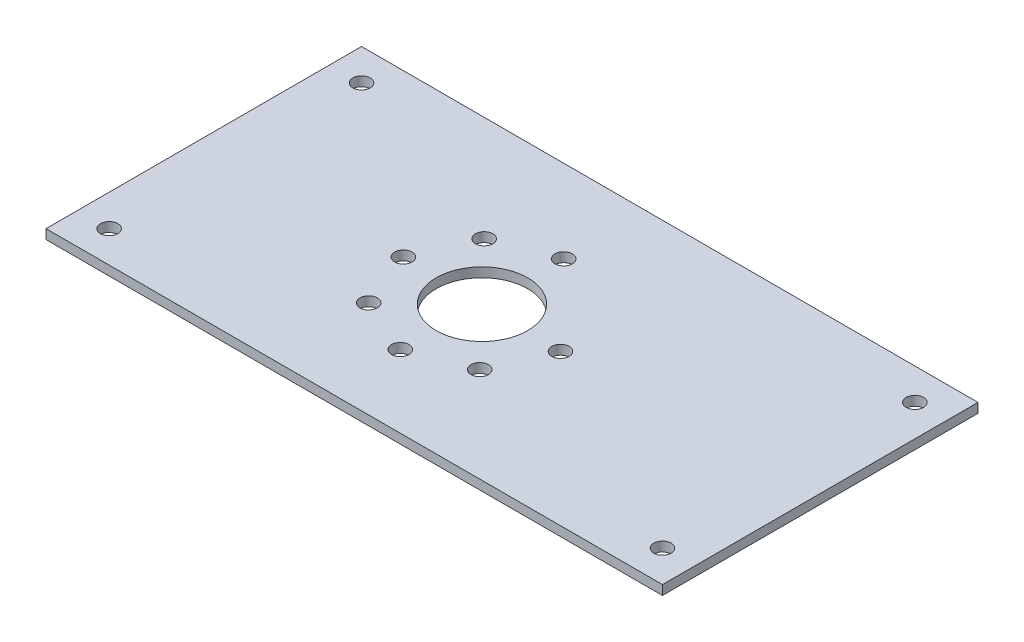
ISO-10303-21;
HEADER;
FILE_DESCRIPTION(('STEP AP214'),'2;1');
FILE_NAME('part.step','',(''),(''),'','','');
FILE_SCHEMA(('AUTOMOTIVE_DESIGN { 1 0 10303 214 1 1 1 1 }'));
ENDSEC;
DATA;
#1=APPLICATION_CONTEXT('core data for automotive mechanical design processes');
#2=APPLICATION_PROTOCOL_DEFINITION('international standard','automotive_design',2000,#1);
#3=PRODUCT_CONTEXT('',#1,'mechanical');
#4=PRODUCT('Part','Part','',(#3));
#5=PRODUCT_RELATED_PRODUCT_CATEGORY('part','',(#4));
#6=PRODUCT_DEFINITION_FORMATION('','',#4);
#7=PRODUCT_DEFINITION_CONTEXT('part definition',#1,'design');
#8=PRODUCT_DEFINITION('design','',#6,#7);
#9=PRODUCT_DEFINITION_SHAPE('','',#8);
#10=(LENGTH_UNIT() NAMED_UNIT(*) SI_UNIT(.MILLI.,.METRE.));
#11=(NAMED_UNIT(*) PLANE_ANGLE_UNIT() SI_UNIT($,.RADIAN.));
#12=(NAMED_UNIT(*) SI_UNIT($,.STERADIAN.) SOLID_ANGLE_UNIT());
#13=UNCERTAINTY_MEASURE_WITH_UNIT(LENGTH_MEASURE(1.E-05),#10,'distance_accuracy_value','');
#14=(GEOMETRIC_REPRESENTATION_CONTEXT(3) GLOBAL_UNCERTAINTY_ASSIGNED_CONTEXT((#13)) GLOBAL_UNIT_ASSIGNED_CONTEXT((#10,
#11,#12)) REPRESENTATION_CONTEXT('',''));
#15=CARTESIAN_POINT('',(0.,0.,0.));
#16=DIRECTION('',(0.,0.,1.));
#17=DIRECTION('',(1.,0.,0.));
#18=AXIS2_PLACEMENT_3D('',#15,#16,#17);
#19=CARTESIAN_POINT('',(0.,3.,0.));
#20=DIRECTION('',(1.,0.,0.));
#21=DIRECTION('',(0.,0.,-1.));
#22=AXIS2_PLACEMENT_3D('',#19,#20,#21);
#23=PLANE('',#22);
#24=DIRECTION('',(0.,0.,1.));
#25=VECTOR('',#24,1.);
#26=CARTESIAN_POINT('',(0.,0.,0.));
#27=LINE('',#26,#25);
#28=CARTESIAN_POINT('',(0.,0.,0.));
#29=VERTEX_POINT('',#28);
#30=CARTESIAN_POINT('',(0.,0.,100.));
#31=VERTEX_POINT('',#30);
#32=EDGE_CURVE('E105',#29,#31,#27,.T.);
#33=ORIENTED_EDGE('',*,*,#32,.T.);
#34=DIRECTION('',(0.,-1.,0.));
#35=VECTOR('',#34,1.);
#36=CARTESIAN_POINT('',(0.,3.,100.));
#37=LINE('',#36,#35);
#38=CARTESIAN_POINT('',(0.,3.,100.));
#39=VERTEX_POINT('',#38);
#40=EDGE_CURVE('E11',#39,#31,#37,.T.);
#41=ORIENTED_EDGE('',*,*,#40,.F.);
#42=DIRECTION('',(0.,0.,1.));
#43=VECTOR('',#42,1.);
#44=CARTESIAN_POINT('',(0.,3.,0.));
#45=LINE('',#44,#43);
#46=CARTESIAN_POINT('',(0.,3.,0.));
#47=VERTEX_POINT('',#46);
#48=EDGE_CURVE('E89',#47,#39,#45,.T.);
#49=ORIENTED_EDGE('',*,*,#48,.F.);
#50=DIRECTION('',(0.,-1.,0.));
#51=VECTOR('',#50,1.);
#52=CARTESIAN_POINT('',(0.,3.,0.));
#53=LINE('',#52,#51);
#54=EDGE_CURVE('E96',#47,#29,#53,.T.);
#55=ORIENTED_EDGE('',*,*,#54,.T.);
#56=EDGE_LOOP('',(#33,#41,#49,#55));
#57=FACE_BOUND('',#56,.T.);
#58=ADVANCED_FACE('F39',(#57),#23,.F.);
#59=CARTESIAN_POINT('',(0.,3.,100.));
#60=DIRECTION('',(0.,0.,-1.));
#61=DIRECTION('',(-1.,0.,0.));
#62=AXIS2_PLACEMENT_3D('',#59,#60,#61);
#63=PLANE('',#62);
#64=DIRECTION('',(1.,0.,0.));
#65=VECTOR('',#64,1.);
#66=CARTESIAN_POINT('',(0.,0.,100.));
#67=LINE('',#66,#65);
#68=CARTESIAN_POINT('',(195.38,0.,100.));
#69=VERTEX_POINT('',#68);
#70=EDGE_CURVE('E91',#31,#69,#67,.T.);
#71=ORIENTED_EDGE('',*,*,#70,.T.);
#72=DIRECTION('',(0.,-1.,0.));
#73=VECTOR('',#72,1.);
#74=CARTESIAN_POINT('',(195.38,3.,100.));
#75=LINE('',#74,#73);
#76=CARTESIAN_POINT('',(195.38,3.,100.));
#77=VERTEX_POINT('',#76);
#78=EDGE_CURVE('E50',#77,#69,#75,.T.);
#79=ORIENTED_EDGE('',*,*,#78,.F.);
#80=DIRECTION('',(1.,0.,0.));
#81=VECTOR('',#80,1.);
#82=CARTESIAN_POINT('',(0.,3.,100.));
#83=LINE('',#82,#81);
#84=EDGE_CURVE('E84',#39,#77,#83,.T.);
#85=ORIENTED_EDGE('',*,*,#84,.F.);
#86=ORIENTED_EDGE('',*,*,#40,.T.);
#87=EDGE_LOOP('',(#71,#79,#85,#86));
#88=FACE_BOUND('',#87,.T.);
#89=ADVANCED_FACE('F94',(#88),#63,.F.);
#90=CARTESIAN_POINT('',(195.38,3.,0.));
#91=DIRECTION('',(-1.,0.,0.));
#92=DIRECTION('',(0.,0.,1.));
#93=AXIS2_PLACEMENT_3D('',#90,#91,#92);
#94=PLANE('',#93);
#95=DIRECTION('',(0.,0.,-1.));
#96=VECTOR('',#95,1.);
#97=CARTESIAN_POINT('',(195.38,0.,0.));
#98=LINE('',#97,#96);
#99=CARTESIAN_POINT('',(195.38,0.,0.));
#100=VERTEX_POINT('',#99);
#101=EDGE_CURVE('E75',#69,#100,#98,.T.);
#102=ORIENTED_EDGE('',*,*,#101,.T.);
#103=DIRECTION('',(0.,-1.,0.));
#104=VECTOR('',#103,1.);
#105=CARTESIAN_POINT('',(195.38,3.,0.));
#106=LINE('',#105,#104);
#107=CARTESIAN_POINT('',(195.38,3.,0.));
#108=VERTEX_POINT('',#107);
#109=EDGE_CURVE('E93',#108,#100,#106,.T.);
#110=ORIENTED_EDGE('',*,*,#109,.F.);
#111=DIRECTION('',(0.,0.,-1.));
#112=VECTOR('',#111,1.);
#113=CARTESIAN_POINT('',(195.38,3.,0.));
#114=LINE('',#113,#112);
#115=EDGE_CURVE('E88',#77,#108,#114,.T.);
#116=ORIENTED_EDGE('',*,*,#115,.F.);
#117=ORIENTED_EDGE('',*,*,#78,.T.);
#118=EDGE_LOOP('',(#102,#110,#116,#117));
#119=FACE_BOUND('',#118,.T.);
#120=ADVANCED_FACE('F98',(#119),#94,.F.);
#121=CARTESIAN_POINT('',(0.,3.,0.));
#122=DIRECTION('',(0.,0.,1.));
#123=DIRECTION('',(1.,0.,0.));
#124=AXIS2_PLACEMENT_3D('',#121,#122,#123);
#125=PLANE('',#124);
#126=DIRECTION('',(-1.,0.,0.));
#127=VECTOR('',#126,1.);
#128=CARTESIAN_POINT('',(0.,0.,0.));
#129=LINE('',#128,#127);
#130=EDGE_CURVE('E76',#100,#29,#129,.T.);
#131=ORIENTED_EDGE('',*,*,#130,.T.);
#132=ORIENTED_EDGE('',*,*,#54,.F.);
#133=DIRECTION('',(-1.,0.,0.));
#134=VECTOR('',#133,1.);
#135=CARTESIAN_POINT('',(0.,3.,0.));
#136=LINE('',#135,#134);
#137=EDGE_CURVE('E54',#108,#47,#136,.T.);
#138=ORIENTED_EDGE('',*,*,#137,.F.);
#139=ORIENTED_EDGE('',*,*,#109,.T.);
#140=EDGE_LOOP('',(#131,#132,#138,#139));
#141=FACE_BOUND('',#140,.T.);
#142=ADVANCED_FACE('F109',(#141),#125,.F.);
#143=CARTESIAN_POINT('',(0.,3.,0.));
#144=DIRECTION('',(0.,1.,0.));
#145=DIRECTION('',(0.,0.,1.));
#146=AXIS2_PLACEMENT_3D('',#143,#144,#145);
#147=PLANE('',#146);
#148=CARTESIAN_POINT('',(90.3169112638323,3.,26.2562197236979));
#149=DIRECTION('',(0.,1.,0.));
#150=DIRECTION('',(0.,0.,1.));
#151=AXIS2_PLACEMENT_3D('',#148,#149,#150);
#152=CIRCLE('',#151,2.75000000000001);
#153=CARTESIAN_POINT('',(90.3169112638323,3.,29.006219723698));
#154=VERTEX_POINT('',#153);
#155=EDGE_CURVE('E164',#154,#154,#152,.T.);
#156=ORIENTED_EDGE('',*,*,#155,.F.);
#157=EDGE_LOOP('',(#156));
#158=FACE_BOUND('',#157,.T.);
#159=CARTESIAN_POINT('',(89.8144438780788,3.,51.6512492871037));
#160=DIRECTION('',(0.,1.,0.));
#161=DIRECTION('',(0.,0.,1.));
#162=AXIS2_PLACEMENT_3D('',#159,#160,#161);
#163=CIRCLE('',#162,14.5);
#164=CARTESIAN_POINT('',(89.8144438780788,3.,66.1512492871037));
#165=VERTEX_POINT('',#164);
#166=EDGE_CURVE('E169',#165,#165,#163,.T.);
#167=ORIENTED_EDGE('',*,*,#166,.F.);
#168=EDGE_LOOP('',(#167));
#169=FACE_BOUND('',#168,.T.);
#170=CARTESIAN_POINT('',(71.5021481695703,3.,69.2529488040295));
#171=DIRECTION('',(0.,1.,0.));
#172=DIRECTION('',(0.,0.,1.));
#173=AXIS2_PLACEMENT_3D('',#170,#171,#172);
#174=CIRCLE('',#173,2.75000000000001);
#175=CARTESIAN_POINT('',(71.5021481695703,3.,72.0029488040295));
#176=VERTEX_POINT('',#175);
#177=EDGE_CURVE('E174',#176,#176,#174,.T.);
#178=ORIENTED_EDGE('',*,*,#177,.F.);
#179=EDGE_LOOP('',(#178));
#180=FACE_BOUND('',#179,.T.);
#181=CARTESIAN_POINT('',(89.3119764923253,3.,77.0462788505095));
#182=DIRECTION('',(0.,1.,0.));
#183=DIRECTION('',(0.,0.,1.));
#184=AXIS2_PLACEMENT_3D('',#181,#182,#183);
#185=CIRCLE('',#184,2.75000000000001);
#186=CARTESIAN_POINT('',(89.3119764923253,3.,79.7962788505095));
#187=VERTEX_POINT('',#186);
#188=EDGE_CURVE('E144',#187,#187,#185,.T.);
#189=ORIENTED_EDGE('',*,*,#188,.F.);
#190=EDGE_LOOP('',(#189));
#191=FACE_BOUND('',#190,.T.);
#192=CARTESIAN_POINT('',(107.416143395005,3.,69.9635449956122));
#193=DIRECTION('',(0.,1.,0.));
#194=DIRECTION('',(0.,0.,1.));
#195=AXIS2_PLACEMENT_3D('',#192,#193,#194);
#196=CIRCLE('',#195,2.75000000000001);
#197=CARTESIAN_POINT('',(107.416143395005,3.,72.7135449956122));
#198=VERTEX_POINT('',#197);
#199=EDGE_CURVE('E141',#198,#198,#196,.T.);
#200=ORIENTED_EDGE('',*,*,#199,.F.);
#201=EDGE_LOOP('',(#200));
#202=FACE_BOUND('',#201,.T.);
#203=CARTESIAN_POINT('',(115.209473441485,3.,52.1537166728571));
#204=DIRECTION('',(0.,1.,0.));
#205=DIRECTION('',(0.,0.,1.));
#206=AXIS2_PLACEMENT_3D('',#203,#204,#205);
#207=CIRCLE('',#206,2.75000000000012);
#208=CARTESIAN_POINT('',(115.209473441485,3.,54.9037166728572));
#209=VERTEX_POINT('',#208);
#210=EDGE_CURVE('E149',#209,#209,#207,.T.);
#211=ORIENTED_EDGE('',*,*,#210,.F.);
#212=EDGE_LOOP('',(#211));
#213=FACE_BOUND('',#212,.T.);
#214=CARTESIAN_POINT('',(64.419414314673,3.,51.1487819013503));
#215=DIRECTION('',(0.,1.,0.));
#216=DIRECTION('',(0.,0.,1.));
#217=AXIS2_PLACEMENT_3D('',#214,#215,#216);
#218=CIRCLE('',#217,2.75000000000001);
#219=CARTESIAN_POINT('',(64.419414314673,3.,53.8987819013503));
#220=VERTEX_POINT('',#219);
#221=EDGE_CURVE('E157',#220,#220,#218,.T.);
#222=ORIENTED_EDGE('',*,*,#221,.F.);
#223=EDGE_LOOP('',(#222));
#224=FACE_BOUND('',#223,.T.);
#225=CARTESIAN_POINT('',(72.2127443611531,3.,33.3389535785953));
#226=DIRECTION('',(0.,1.,0.));
#227=DIRECTION('',(0.,0.,1.));
#228=AXIS2_PLACEMENT_3D('',#225,#226,#227);
#229=CIRCLE('',#228,2.75000000000001);
#230=CARTESIAN_POINT('',(72.2127443611531,3.,36.0889535785953));
#231=VERTEX_POINT('',#230);
#232=EDGE_CURVE('E162',#231,#231,#229,.T.);
#233=ORIENTED_EDGE('',*,*,#232,.F.);
#234=EDGE_LOOP('',(#233));
#235=FACE_BOUND('',#234,.T.);
#236=CARTESIAN_POINT('',(10.,3.,10.));
#237=DIRECTION('',(0.,1.,0.));
#238=DIRECTION('',(0.,0.,1.));
#239=AXIS2_PLACEMENT_3D('',#236,#237,#238);
#240=CIRCLE('',#239,2.75);
#241=CARTESIAN_POINT('',(10.,3.,12.75));
#242=VERTEX_POINT('',#241);
#243=EDGE_CURVE('E123',#242,#242,#240,.T.);
#244=ORIENTED_EDGE('',*,*,#243,.F.);
#245=EDGE_LOOP('',(#244));
#246=FACE_BOUND('',#245,.T.);
#247=CARTESIAN_POINT('',(10.,3.,90.));
#248=DIRECTION('',(0.,1.,0.));
#249=DIRECTION('',(0.,0.,1.));
#250=AXIS2_PLACEMENT_3D('',#247,#248,#249);
#251=CIRCLE('',#250,2.75);
#252=CARTESIAN_POINT('',(10.,3.,92.75));
#253=VERTEX_POINT('',#252);
#254=EDGE_CURVE('E135',#253,#253,#251,.T.);
#255=ORIENTED_EDGE('',*,*,#254,.F.);
#256=EDGE_LOOP('',(#255));
#257=FACE_BOUND('',#256,.T.);
#258=CARTESIAN_POINT('',(185.38,3.,90.));
#259=DIRECTION('',(0.,1.,0.));
#260=DIRECTION('',(0.,0.,1.));
#261=AXIS2_PLACEMENT_3D('',#258,#259,#260);
#262=CIRCLE('',#261,2.75000000000001);
#263=CARTESIAN_POINT('',(185.38,3.,92.75));
#264=VERTEX_POINT('',#263);
#265=EDGE_CURVE('E118',#264,#264,#262,.T.);
#266=ORIENTED_EDGE('',*,*,#265,.F.);
#267=EDGE_LOOP('',(#266));
#268=FACE_BOUND('',#267,.T.);
#269=CARTESIAN_POINT('',(185.38,3.,10.));
#270=DIRECTION('',(0.,1.,0.));
#271=DIRECTION('',(0.,0.,1.));
#272=AXIS2_PLACEMENT_3D('',#269,#270,#271);
#273=CIRCLE('',#272,2.75000000000001);
#274=CARTESIAN_POINT('',(185.38,3.,12.75));
#275=VERTEX_POINT('',#274);
#276=EDGE_CURVE('E116',#275,#275,#273,.T.);
#277=ORIENTED_EDGE('',*,*,#276,.F.);
#278=EDGE_LOOP('',(#277));
#279=FACE_BOUND('',#278,.T.);
#280=ORIENTED_EDGE('',*,*,#48,.T.);
#281=ORIENTED_EDGE('',*,*,#84,.T.);
#282=ORIENTED_EDGE('',*,*,#115,.T.);
#283=ORIENTED_EDGE('',*,*,#137,.T.);
#284=EDGE_LOOP('',(#280,#281,#282,#283));
#285=FACE_BOUND('',#284,.T.);
#286=ADVANCED_FACE('F86',(#158,#169,#180,#191,#202,#213,#224,#235,#246,#257,#268,#279,#285),
#147,.T.);
#287=CARTESIAN_POINT('',(0.,0.,0.));
#288=DIRECTION('',(0.,1.,0.));
#289=DIRECTION('',(0.,0.,1.));
#290=AXIS2_PLACEMENT_3D('',#287,#288,#289);
#291=PLANE('',#290);
#292=CARTESIAN_POINT('',(90.3169112638323,0.,26.2562197236979));
#293=DIRECTION('',(0.,1.,0.));
#294=DIRECTION('',(0.,0.,1.));
#295=AXIS2_PLACEMENT_3D('',#292,#293,#294);
#296=CIRCLE('',#295,2.75000000000001);
#297=CARTESIAN_POINT('',(90.3169112638323,0.,29.006219723698));
#298=VERTEX_POINT('',#297);
#299=EDGE_CURVE('E126',#298,#298,#296,.T.);
#300=ORIENTED_EDGE('',*,*,#299,.T.);
#301=EDGE_LOOP('',(#300));
#302=FACE_BOUND('',#301,.T.);
#303=CARTESIAN_POINT('',(89.8144438780788,0.,51.6512492871037));
#304=DIRECTION('',(0.,1.,0.));
#305=DIRECTION('',(0.,0.,1.));
#306=AXIS2_PLACEMENT_3D('',#303,#304,#305);
#307=CIRCLE('',#306,14.5);
#308=CARTESIAN_POINT('',(89.8144438780788,0.,66.1512492871037));
#309=VERTEX_POINT('',#308);
#310=EDGE_CURVE('E168',#309,#309,#307,.T.);
#311=ORIENTED_EDGE('',*,*,#310,.T.);
#312=EDGE_LOOP('',(#311));
#313=FACE_BOUND('',#312,.T.);
#314=CARTESIAN_POINT('',(71.5021481695703,0.,69.2529488040295));
#315=DIRECTION('',(0.,1.,0.));
#316=DIRECTION('',(0.,0.,1.));
#317=AXIS2_PLACEMENT_3D('',#314,#315,#316);
#318=CIRCLE('',#317,2.75000000000001);
#319=CARTESIAN_POINT('',(71.5021481695703,0.,72.0029488040295));
#320=VERTEX_POINT('',#319);
#321=EDGE_CURVE('E175',#320,#320,#318,.T.);
#322=ORIENTED_EDGE('',*,*,#321,.T.);
#323=EDGE_LOOP('',(#322));
#324=FACE_BOUND('',#323,.T.);
#325=CARTESIAN_POINT('',(89.3119764923253,0.,77.0462788505095));
#326=DIRECTION('',(0.,1.,0.));
#327=DIRECTION('',(0.,0.,1.));
#328=AXIS2_PLACEMENT_3D('',#325,#326,#327);
#329=CIRCLE('',#328,2.75000000000001);
#330=CARTESIAN_POINT('',(89.3119764923253,0.,79.7962788505095));
#331=VERTEX_POINT('',#330);
#332=EDGE_CURVE('E178',#331,#331,#329,.T.);
#333=ORIENTED_EDGE('',*,*,#332,.T.);
#334=EDGE_LOOP('',(#333));
#335=FACE_BOUND('',#334,.T.);
#336=CARTESIAN_POINT('',(107.416143395005,0.,69.9635449956122));
#337=DIRECTION('',(0.,1.,0.));
#338=DIRECTION('',(0.,0.,1.));
#339=AXIS2_PLACEMENT_3D('',#336,#337,#338);
#340=CIRCLE('',#339,2.75000000000001);
#341=CARTESIAN_POINT('',(107.416143395005,0.,72.7135449956122));
#342=VERTEX_POINT('',#341);
#343=EDGE_CURVE('E138',#342,#342,#340,.T.);
#344=ORIENTED_EDGE('',*,*,#343,.T.);
#345=EDGE_LOOP('',(#344));
#346=FACE_BOUND('',#345,.T.);
#347=CARTESIAN_POINT('',(115.209473441485,0.,52.1537166728571));
#348=DIRECTION('',(0.,1.,0.));
#349=DIRECTION('',(0.,0.,1.));
#350=AXIS2_PLACEMENT_3D('',#347,#348,#349);
#351=CIRCLE('',#350,2.75000000000012);
#352=CARTESIAN_POINT('',(115.209473441485,0.,54.9037166728572));
#353=VERTEX_POINT('',#352);
#354=EDGE_CURVE('E150',#353,#353,#351,.T.);
#355=ORIENTED_EDGE('',*,*,#354,.T.);
#356=EDGE_LOOP('',(#355));
#357=FACE_BOUND('',#356,.T.);
#358=CARTESIAN_POINT('',(64.419414314673,0.,51.1487819013503));
#359=DIRECTION('',(0.,1.,0.));
#360=DIRECTION('',(0.,0.,1.));
#361=AXIS2_PLACEMENT_3D('',#358,#359,#360);
#362=CIRCLE('',#361,2.75000000000001);
#363=CARTESIAN_POINT('',(64.419414314673,0.,53.8987819013503));
#364=VERTEX_POINT('',#363);
#365=EDGE_CURVE('E153',#364,#364,#362,.T.);
#366=ORIENTED_EDGE('',*,*,#365,.T.);
#367=EDGE_LOOP('',(#366));
#368=FACE_BOUND('',#367,.T.);
#369=CARTESIAN_POINT('',(72.2127443611531,0.,33.3389535785953));
#370=DIRECTION('',(0.,1.,0.));
#371=DIRECTION('',(0.,0.,1.));
#372=AXIS2_PLACEMENT_3D('',#369,#370,#371);
#373=CIRCLE('',#372,2.75000000000001);
#374=CARTESIAN_POINT('',(72.2127443611531,0.,36.0889535785953));
#375=VERTEX_POINT('',#374);
#376=EDGE_CURVE('E156',#375,#375,#373,.T.);
#377=ORIENTED_EDGE('',*,*,#376,.T.);
#378=EDGE_LOOP('',(#377));
#379=FACE_BOUND('',#378,.T.);
#380=CARTESIAN_POINT('',(10.,0.,10.));
#381=DIRECTION('',(0.,1.,0.));
#382=DIRECTION('',(0.,0.,1.));
#383=AXIS2_PLACEMENT_3D('',#380,#381,#382);
#384=CIRCLE('',#383,2.75);
#385=CARTESIAN_POINT('',(10.,0.,12.75));
#386=VERTEX_POINT('',#385);
#387=EDGE_CURVE('E125',#386,#386,#384,.T.);
#388=ORIENTED_EDGE('',*,*,#387,.T.);
#389=EDGE_LOOP('',(#388));
#390=FACE_BOUND('',#389,.T.);
#391=CARTESIAN_POINT('',(10.,0.,90.));
#392=DIRECTION('',(0.,1.,0.));
#393=DIRECTION('',(0.,0.,1.));
#394=AXIS2_PLACEMENT_3D('',#391,#392,#393);
#395=CIRCLE('',#394,2.75);
#396=CARTESIAN_POINT('',(10.,0.,92.75));
#397=VERTEX_POINT('',#396);
#398=EDGE_CURVE('E128',#397,#397,#395,.T.);
#399=ORIENTED_EDGE('',*,*,#398,.T.);
#400=EDGE_LOOP('',(#399));
#401=FACE_BOUND('',#400,.T.);
#402=CARTESIAN_POINT('',(185.38,0.,90.));
#403=DIRECTION('',(0.,1.,0.));
#404=DIRECTION('',(0.,0.,1.));
#405=AXIS2_PLACEMENT_3D('',#402,#403,#404);
#406=CIRCLE('',#405,2.75000000000001);
#407=CARTESIAN_POINT('',(185.38,0.,92.75));
#408=VERTEX_POINT('',#407);
#409=EDGE_CURVE('E134',#408,#408,#406,.T.);
#410=ORIENTED_EDGE('',*,*,#409,.T.);
#411=EDGE_LOOP('',(#410));
#412=FACE_BOUND('',#411,.T.);
#413=CARTESIAN_POINT('',(185.38,0.,10.));
#414=DIRECTION('',(0.,1.,0.));
#415=DIRECTION('',(0.,0.,1.));
#416=AXIS2_PLACEMENT_3D('',#413,#414,#415);
#417=CIRCLE('',#416,2.75000000000001);
#418=CARTESIAN_POINT('',(185.38,0.,12.75));
#419=VERTEX_POINT('',#418);
#420=EDGE_CURVE('E102',#419,#419,#417,.T.);
#421=ORIENTED_EDGE('',*,*,#420,.T.);
#422=EDGE_LOOP('',(#421));
#423=FACE_BOUND('',#422,.T.);
#424=ORIENTED_EDGE('',*,*,#32,.F.);
#425=ORIENTED_EDGE('',*,*,#130,.F.);
#426=ORIENTED_EDGE('',*,*,#101,.F.);
#427=ORIENTED_EDGE('',*,*,#70,.F.);
#428=EDGE_LOOP('',(#424,#425,#426,#427));
#429=FACE_BOUND('',#428,.T.);
#430=ADVANCED_FACE('F113',(#302,#313,#324,#335,#346,#357,#368,#379,#390,#401,#412,#423,#429),
#291,.F.);
#431=CARTESIAN_POINT('',(185.38,0.,10.));
#432=DIRECTION('',(0.,1.,0.));
#433=DIRECTION('',(0.,0.,1.));
#434=AXIS2_PLACEMENT_3D('',#431,#432,#433);
#435=CYLINDRICAL_SURFACE('',#434,2.75000000000001);
#436=ORIENTED_EDGE('',*,*,#420,.F.);
#437=EDGE_LOOP('',(#436));
#438=FACE_BOUND('',#437,.T.);
#439=ORIENTED_EDGE('',*,*,#276,.T.);
#440=EDGE_LOOP('',(#439));
#441=FACE_BOUND('',#440,.T.);
#442=ADVANCED_FACE('F225',(#438,#441),#435,.F.);
#443=CARTESIAN_POINT('',(185.38,0.,90.));
#444=DIRECTION('',(0.,1.,0.));
#445=DIRECTION('',(0.,0.,1.));
#446=AXIS2_PLACEMENT_3D('',#443,#444,#445);
#447=CYLINDRICAL_SURFACE('',#446,2.75000000000001);
#448=ORIENTED_EDGE('',*,*,#409,.F.);
#449=EDGE_LOOP('',(#448));
#450=FACE_BOUND('',#449,.T.);
#451=ORIENTED_EDGE('',*,*,#265,.T.);
#452=EDGE_LOOP('',(#451));
#453=FACE_BOUND('',#452,.T.);
#454=ADVANCED_FACE('F221',(#450,#453),#447,.F.);
#455=CARTESIAN_POINT('',(10.,0.,90.));
#456=DIRECTION('',(0.,1.,0.));
#457=DIRECTION('',(0.,0.,1.));
#458=AXIS2_PLACEMENT_3D('',#455,#456,#457);
#459=CYLINDRICAL_SURFACE('',#458,2.75);
#460=ORIENTED_EDGE('',*,*,#398,.F.);
#461=EDGE_LOOP('',(#460));
#462=FACE_BOUND('',#461,.T.);
#463=ORIENTED_EDGE('',*,*,#254,.T.);
#464=EDGE_LOOP('',(#463));
#465=FACE_BOUND('',#464,.T.);
#466=ADVANCED_FACE('F233',(#462,#465),#459,.F.);
#467=CARTESIAN_POINT('',(10.,0.,10.));
#468=DIRECTION('',(0.,1.,0.));
#469=DIRECTION('',(0.,0.,1.));
#470=AXIS2_PLACEMENT_3D('',#467,#468,#469);
#471=CYLINDRICAL_SURFACE('',#470,2.75);
#472=ORIENTED_EDGE('',*,*,#387,.F.);
#473=EDGE_LOOP('',(#472));
#474=FACE_BOUND('',#473,.T.);
#475=ORIENTED_EDGE('',*,*,#243,.T.);
#476=EDGE_LOOP('',(#475));
#477=FACE_BOUND('',#476,.T.);
#478=ADVANCED_FACE('F293',(#474,#477),#471,.F.);
#479=CARTESIAN_POINT('',(72.2127443611531,0.,33.3389535785953));
#480=DIRECTION('',(0.,1.,0.));
#481=DIRECTION('',(0.,0.,1.));
#482=AXIS2_PLACEMENT_3D('',#479,#480,#481);
#483=CYLINDRICAL_SURFACE('',#482,2.75000000000001);
#484=ORIENTED_EDGE('',*,*,#376,.F.);
#485=EDGE_LOOP('',(#484));
#486=FACE_BOUND('',#485,.T.);
#487=ORIENTED_EDGE('',*,*,#232,.T.);
#488=EDGE_LOOP('',(#487));
#489=FACE_BOUND('',#488,.T.);
#490=ADVANCED_FACE('F297',(#486,#489),#483,.F.);
#491=CARTESIAN_POINT('',(64.419414314673,0.,51.1487819013503));
#492=DIRECTION('',(0.,1.,0.));
#493=DIRECTION('',(0.,0.,1.));
#494=AXIS2_PLACEMENT_3D('',#491,#492,#493);
#495=CYLINDRICAL_SURFACE('',#494,2.75000000000001);
#496=ORIENTED_EDGE('',*,*,#365,.F.);
#497=EDGE_LOOP('',(#496));
#498=FACE_BOUND('',#497,.T.);
#499=ORIENTED_EDGE('',*,*,#221,.T.);
#500=EDGE_LOOP('',(#499));
#501=FACE_BOUND('',#500,.T.);
#502=ADVANCED_FACE('F308',(#498,#501),#495,.F.);
#503=CARTESIAN_POINT('',(115.209473441485,0.,52.1537166728571));
#504=DIRECTION('',(0.,1.,0.));
#505=DIRECTION('',(0.,0.,1.));
#506=AXIS2_PLACEMENT_3D('',#503,#504,#505);
#507=CYLINDRICAL_SURFACE('',#506,2.75000000000012);
#508=ORIENTED_EDGE('',*,*,#354,.F.);
#509=EDGE_LOOP('',(#508));
#510=FACE_BOUND('',#509,.T.);
#511=ORIENTED_EDGE('',*,*,#210,.T.);
#512=EDGE_LOOP('',(#511));
#513=FACE_BOUND('',#512,.T.);
#514=ADVANCED_FACE('F320',(#510,#513),#507,.F.);
#515=CARTESIAN_POINT('',(107.416143395005,0.,69.9635449956122));
#516=DIRECTION('',(0.,1.,0.));
#517=DIRECTION('',(0.,0.,1.));
#518=AXIS2_PLACEMENT_3D('',#515,#516,#517);
#519=CYLINDRICAL_SURFACE('',#518,2.75000000000001);
#520=ORIENTED_EDGE('',*,*,#343,.F.);
#521=EDGE_LOOP('',(#520));
#522=FACE_BOUND('',#521,.T.);
#523=ORIENTED_EDGE('',*,*,#199,.T.);
#524=EDGE_LOOP('',(#523));
#525=FACE_BOUND('',#524,.T.);
#526=ADVANCED_FACE('F326',(#522,#525),#519,.F.);
#527=CARTESIAN_POINT('',(89.3119764923253,0.,77.0462788505095));
#528=DIRECTION('',(0.,1.,0.));
#529=DIRECTION('',(0.,0.,1.));
#530=AXIS2_PLACEMENT_3D('',#527,#528,#529);
#531=CYLINDRICAL_SURFACE('',#530,2.75000000000001);
#532=ORIENTED_EDGE('',*,*,#332,.F.);
#533=EDGE_LOOP('',(#532));
#534=FACE_BOUND('',#533,.T.);
#535=ORIENTED_EDGE('',*,*,#188,.T.);
#536=EDGE_LOOP('',(#535));
#537=FACE_BOUND('',#536,.T.);
#538=ADVANCED_FACE('F333',(#534,#537),#531,.F.);
#539=CARTESIAN_POINT('',(71.5021481695703,0.,69.2529488040295));
#540=DIRECTION('',(0.,1.,0.));
#541=DIRECTION('',(0.,0.,1.));
#542=AXIS2_PLACEMENT_3D('',#539,#540,#541);
#543=CYLINDRICAL_SURFACE('',#542,2.75000000000001);
#544=ORIENTED_EDGE('',*,*,#321,.F.);
#545=EDGE_LOOP('',(#544));
#546=FACE_BOUND('',#545,.T.);
#547=ORIENTED_EDGE('',*,*,#177,.T.);
#548=EDGE_LOOP('',(#547));
#549=FACE_BOUND('',#548,.T.);
#550=ADVANCED_FACE('F343',(#546,#549),#543,.F.);
#551=CARTESIAN_POINT('',(89.8144438780788,0.,51.6512492871037));
#552=DIRECTION('',(0.,1.,0.));
#553=DIRECTION('',(0.,0.,1.));
#554=AXIS2_PLACEMENT_3D('',#551,#552,#553);
#555=CYLINDRICAL_SURFACE('',#554,14.5);
#556=ORIENTED_EDGE('',*,*,#310,.F.);
#557=EDGE_LOOP('',(#556));
#558=FACE_BOUND('',#557,.T.);
#559=ORIENTED_EDGE('',*,*,#166,.T.);
#560=EDGE_LOOP('',(#559));
#561=FACE_BOUND('',#560,.T.);
#562=ADVANCED_FACE('F192',(#558,#561),#555,.F.);
#563=CARTESIAN_POINT('',(90.3169112638323,0.,26.2562197236979));
#564=DIRECTION('',(0.,1.,0.));
#565=DIRECTION('',(0.,0.,1.));
#566=AXIS2_PLACEMENT_3D('',#563,#564,#565);
#567=CYLINDRICAL_SURFACE('',#566,2.75000000000001);
#568=ORIENTED_EDGE('',*,*,#299,.F.);
#569=EDGE_LOOP('',(#568));
#570=FACE_BOUND('',#569,.T.);
#571=ORIENTED_EDGE('',*,*,#155,.T.);
#572=EDGE_LOOP('',(#571));
#573=FACE_BOUND('',#572,.T.);
#574=ADVANCED_FACE('F188',(#570,#573),#567,.F.);
#575=CLOSED_SHELL('',(#58,#89,#120,#142,#286,#430,#442,#454,#466,#478,#490,#502,#514,#526,#538,
#550,#562,#574));
#576=MANIFOLD_SOLID_BREP('B2',#575);
#577=ADVANCED_BREP_SHAPE_REPRESENTATION('',(#18,#576),#14);
#578=SHAPE_DEFINITION_REPRESENTATION(#9,#577);
ENDSEC;
END-ISO-10303-21;
